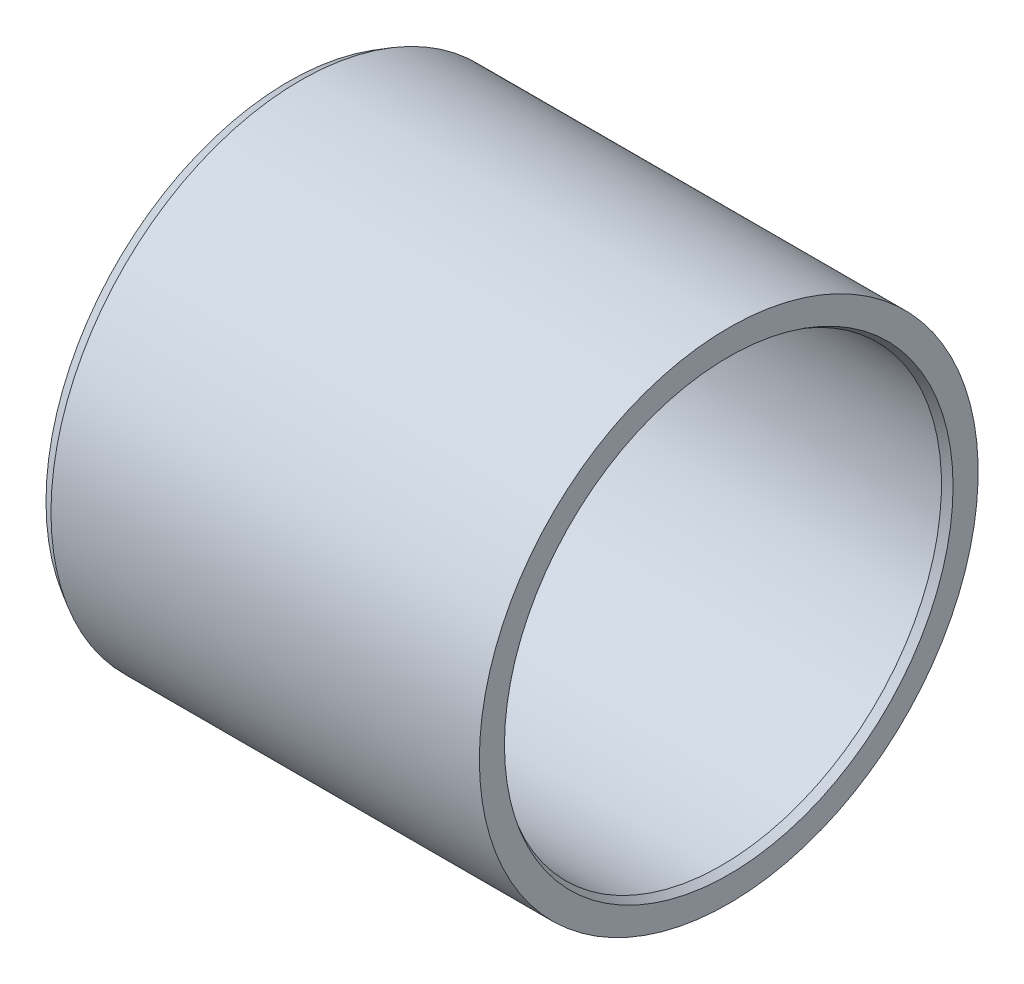
ISO-10303-21;
HEADER;
FILE_DESCRIPTION(('STEP AP214'),'2;1');
FILE_NAME('part.step','',(''),(''),'','','');
FILE_SCHEMA(('AUTOMOTIVE_DESIGN { 1 0 10303 214 1 1 1 1 }'));
ENDSEC;
DATA;
#1=APPLICATION_CONTEXT('core data for automotive mechanical design processes');
#2=APPLICATION_PROTOCOL_DEFINITION('international standard','automotive_design',2000,#1);
#3=PRODUCT_CONTEXT('',#1,'mechanical');
#4=PRODUCT('Part','Part','',(#3));
#5=PRODUCT_RELATED_PRODUCT_CATEGORY('part','',(#4));
#6=PRODUCT_DEFINITION_FORMATION('','',#4);
#7=PRODUCT_DEFINITION_CONTEXT('part definition',#1,'design');
#8=PRODUCT_DEFINITION('design','',#6,#7);
#9=PRODUCT_DEFINITION_SHAPE('','',#8);
#10=(LENGTH_UNIT() NAMED_UNIT(*) SI_UNIT(.MILLI.,.METRE.));
#11=(NAMED_UNIT(*) PLANE_ANGLE_UNIT() SI_UNIT($,.RADIAN.));
#12=(NAMED_UNIT(*) SI_UNIT($,.STERADIAN.) SOLID_ANGLE_UNIT());
#13=UNCERTAINTY_MEASURE_WITH_UNIT(LENGTH_MEASURE(1.E-05),#10,'distance_accuracy_value','');
#14=(GEOMETRIC_REPRESENTATION_CONTEXT(3) GLOBAL_UNCERTAINTY_ASSIGNED_CONTEXT((#13)) GLOBAL_UNIT_ASSIGNED_CONTEXT((#10,
#11,#12)) REPRESENTATION_CONTEXT('',''));
#15=CARTESIAN_POINT('',(0.,0.,0.));
#16=DIRECTION('',(0.,0.,1.));
#17=DIRECTION('',(1.,0.,0.));
#18=AXIS2_PLACEMENT_3D('',#15,#16,#17);
#19=CARTESIAN_POINT('',(-14.2,0.,0.));
#20=DIRECTION('',(1.,0.,0.));
#21=DIRECTION('',(0.,0.,-1.));
#22=AXIS2_PLACEMENT_3D('',#19,#20,#21);
#23=CONICAL_SURFACE('',#22,17.,0.523598775598301);
#24=CARTESIAN_POINT('',(-15.,0.,0.));
#25=DIRECTION('',(-1.,0.,0.));
#26=DIRECTION('',(0.,0.,1.));
#27=AXIS2_PLACEMENT_3D('',#24,#25,#26);
#28=CIRCLE('',#27,16.5381197846483);
#29=CARTESIAN_POINT('',(-15.,0.,16.5381197846483));
#30=VERTEX_POINT('',#29);
#31=EDGE_CURVE('E54',#30,#30,#28,.T.);
#32=ORIENTED_EDGE('',*,*,#31,.F.);
#33=EDGE_LOOP('',(#32));
#34=FACE_BOUND('',#33,.T.);
#35=CARTESIAN_POINT('',(-14.2,0.,0.));
#36=DIRECTION('',(-1.,0.,0.));
#37=DIRECTION('',(0.,0.,1.));
#38=AXIS2_PLACEMENT_3D('',#35,#36,#37);
#39=CIRCLE('',#38,17.);
#40=CARTESIAN_POINT('',(-14.2,0.,17.));
#41=VERTEX_POINT('',#40);
#42=EDGE_CURVE('E10',#41,#41,#39,.T.);
#43=ORIENTED_EDGE('',*,*,#42,.T.);
#44=EDGE_LOOP('',(#43));
#45=FACE_BOUND('',#44,.T.);
#46=ADVANCED_FACE('F32',(#34,#45),#23,.T.);
#47=CARTESIAN_POINT('',(-15.,0.,0.));
#48=DIRECTION('',(-1.,0.,0.));
#49=DIRECTION('',(0.,0.,1.));
#50=AXIS2_PLACEMENT_3D('',#47,#48,#49);
#51=CYLINDRICAL_SURFACE('',#50,17.);
#52=ORIENTED_EDGE('',*,*,#42,.F.);
#53=EDGE_LOOP('',(#52));
#54=FACE_BOUND('',#53,.T.);
#55=CARTESIAN_POINT('',(15.,0.,0.));
#56=DIRECTION('',(-1.,0.,0.));
#57=DIRECTION('',(0.,0.,1.));
#58=AXIS2_PLACEMENT_3D('',#55,#56,#57);
#59=CIRCLE('',#58,17.);
#60=CARTESIAN_POINT('',(15.,0.,17.));
#61=VERTEX_POINT('',#60);
#62=EDGE_CURVE('E38',#61,#61,#59,.T.);
#63=ORIENTED_EDGE('',*,*,#62,.T.);
#64=EDGE_LOOP('',(#63));
#65=FACE_BOUND('',#64,.T.);
#66=ADVANCED_FACE('F61',(#54,#65),#51,.T.);
#67=CARTESIAN_POINT('',(15.,0.,-17.));
#68=DIRECTION('',(-1.,0.,0.));
#69=DIRECTION('',(0.,0.,1.));
#70=AXIS2_PLACEMENT_3D('',#67,#68,#69);
#71=PLANE('',#70);
#72=ORIENTED_EDGE('',*,*,#62,.F.);
#73=EDGE_LOOP('',(#72));
#74=FACE_BOUND('',#73,.T.);
#75=CARTESIAN_POINT('',(15.,0.,0.));
#76=DIRECTION('',(-1.,0.,0.));
#77=DIRECTION('',(0.,0.,1.));
#78=AXIS2_PLACEMENT_3D('',#75,#76,#77);
#79=CIRCLE('',#78,15.2886751345948);
#80=CARTESIAN_POINT('',(15.,0.,15.2886751345948));
#81=VERTEX_POINT('',#80);
#82=EDGE_CURVE('E42',#81,#81,#79,.T.);
#83=ORIENTED_EDGE('',*,*,#82,.T.);
#84=EDGE_LOOP('',(#83));
#85=FACE_BOUND('',#84,.T.);
#86=ADVANCED_FACE('F65',(#74,#85),#71,.F.);
#87=CARTESIAN_POINT('',(14.5,0.,0.));
#88=DIRECTION('',(1.,0.,0.));
#89=DIRECTION('',(0.,0.,-1.));
#90=AXIS2_PLACEMENT_3D('',#87,#88,#89);
#91=CONICAL_SURFACE('',#90,15.,0.523598775598299);
#92=ORIENTED_EDGE('',*,*,#82,.F.);
#93=EDGE_LOOP('',(#92));
#94=FACE_BOUND('',#93,.T.);
#95=CARTESIAN_POINT('',(14.5,0.,0.));
#96=DIRECTION('',(-1.,0.,0.));
#97=DIRECTION('',(0.,0.,1.));
#98=AXIS2_PLACEMENT_3D('',#95,#96,#97);
#99=CIRCLE('',#98,15.);
#100=CARTESIAN_POINT('',(14.5,0.,15.));
#101=VERTEX_POINT('',#100);
#102=EDGE_CURVE('E46',#101,#101,#99,.T.);
#103=ORIENTED_EDGE('',*,*,#102,.T.);
#104=EDGE_LOOP('',(#103));
#105=FACE_BOUND('',#104,.T.);
#106=ADVANCED_FACE('F70',(#94,#105),#91,.F.);
#107=CARTESIAN_POINT('',(-15.,0.,0.));
#108=DIRECTION('',(-1.,0.,0.));
#109=DIRECTION('',(0.,0.,1.));
#110=AXIS2_PLACEMENT_3D('',#107,#108,#109);
#111=CYLINDRICAL_SURFACE('',#110,15.);
#112=ORIENTED_EDGE('',*,*,#102,.F.);
#113=EDGE_LOOP('',(#112));
#114=FACE_BOUND('',#113,.T.);
#115=CARTESIAN_POINT('',(-15.,0.,0.));
#116=DIRECTION('',(-1.,0.,0.));
#117=DIRECTION('',(0.,0.,1.));
#118=AXIS2_PLACEMENT_3D('',#115,#116,#117);
#119=CIRCLE('',#118,15.);
#120=CARTESIAN_POINT('',(-15.,0.,15.));
#121=VERTEX_POINT('',#120);
#122=EDGE_CURVE('E51',#121,#121,#119,.T.);
#123=ORIENTED_EDGE('',*,*,#122,.T.);
#124=EDGE_LOOP('',(#123));
#125=FACE_BOUND('',#124,.T.);
#126=ADVANCED_FACE('F76',(#114,#125),#111,.F.);
#127=CARTESIAN_POINT('',(-15.,0.,-15.));
#128=DIRECTION('',(1.,0.,0.));
#129=DIRECTION('',(0.,0.,-1.));
#130=AXIS2_PLACEMENT_3D('',#127,#128,#129);
#131=PLANE('',#130);
#132=ORIENTED_EDGE('',*,*,#122,.F.);
#133=EDGE_LOOP('',(#132));
#134=FACE_BOUND('',#133,.T.);
#135=ORIENTED_EDGE('',*,*,#31,.T.);
#136=EDGE_LOOP('',(#135));
#137=FACE_BOUND('',#136,.T.);
#138=ADVANCED_FACE('F58',(#134,#137),#131,.F.);
#139=CLOSED_SHELL('',(#46,#66,#86,#106,#126,#138));
#140=MANIFOLD_SOLID_BREP('B2',#139);
#141=ADVANCED_BREP_SHAPE_REPRESENTATION('',(#18,#140),#14);
#142=SHAPE_DEFINITION_REPRESENTATION(#9,#141);
ENDSEC;
END-ISO-10303-21;
